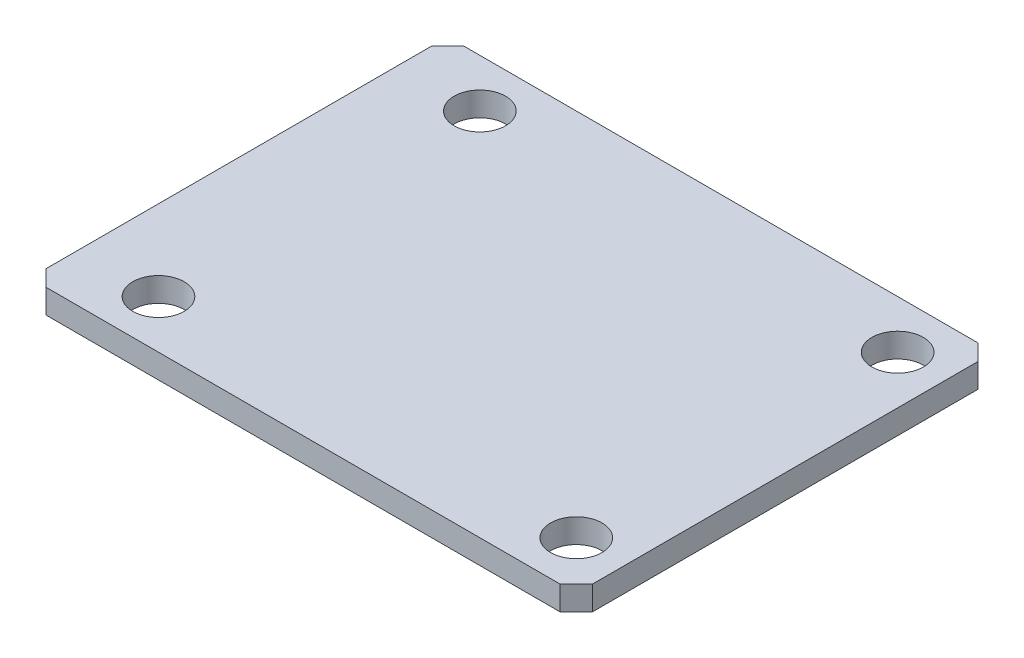
ISO-10303-21;
HEADER;
FILE_DESCRIPTION(('STEP AP214'),'2;1');
FILE_NAME('part.step','',(''),(''),'','','');
FILE_SCHEMA(('AUTOMOTIVE_DESIGN { 1 0 10303 214 1 1 1 1 }'));
ENDSEC;
DATA;
#1=APPLICATION_CONTEXT('core data for automotive mechanical design processes');
#2=APPLICATION_PROTOCOL_DEFINITION('international standard','automotive_design',2000,#1);
#3=PRODUCT_CONTEXT('',#1,'mechanical');
#4=PRODUCT('Part','Part','',(#3));
#5=PRODUCT_RELATED_PRODUCT_CATEGORY('part','',(#4));
#6=PRODUCT_DEFINITION_FORMATION('','',#4);
#7=PRODUCT_DEFINITION_CONTEXT('part definition',#1,'design');
#8=PRODUCT_DEFINITION('design','',#6,#7);
#9=PRODUCT_DEFINITION_SHAPE('','',#8);
#10=(LENGTH_UNIT() NAMED_UNIT(*) SI_UNIT(.MILLI.,.METRE.));
#11=(NAMED_UNIT(*) PLANE_ANGLE_UNIT() SI_UNIT($,.RADIAN.));
#12=(NAMED_UNIT(*) SI_UNIT($,.STERADIAN.) SOLID_ANGLE_UNIT());
#13=UNCERTAINTY_MEASURE_WITH_UNIT(LENGTH_MEASURE(1.E-05),#10,'distance_accuracy_value','');
#14=(GEOMETRIC_REPRESENTATION_CONTEXT(3) GLOBAL_UNCERTAINTY_ASSIGNED_CONTEXT((#13)) GLOBAL_UNIT_ASSIGNED_CONTEXT((#10,
#11,#12)) REPRESENTATION_CONTEXT('',''));
#15=CARTESIAN_POINT('',(0.,0.,0.));
#16=DIRECTION('',(0.,0.,1.));
#17=DIRECTION('',(1.,0.,0.));
#18=AXIS2_PLACEMENT_3D('',#15,#16,#17);
#19=CARTESIAN_POINT('',(-17.,1.5,12.));
#20=DIRECTION('',(1.,0.,0.));
#21=DIRECTION('',(0.,0.,-1.));
#22=AXIS2_PLACEMENT_3D('',#19,#20,#21);
#23=PLANE('',#22);
#24=DIRECTION('',(0.,0.,1.));
#25=VECTOR('',#24,1.);
#26=CARTESIAN_POINT('',(-17.,0.,12.));
#27=LINE('',#26,#25);
#28=CARTESIAN_POINT('',(-17.,0.,-12.));
#29=VERTEX_POINT('',#28);
#30=CARTESIAN_POINT('',(-17.,0.,12.));
#31=VERTEX_POINT('',#30);
#32=EDGE_CURVE('E139',#29,#31,#27,.T.);
#33=ORIENTED_EDGE('',*,*,#32,.T.);
#34=DIRECTION('',(0.,-1.,0.));
#35=VECTOR('',#34,1.);
#36=CARTESIAN_POINT('',(-17.,1.5,12.));
#37=LINE('',#36,#35);
#38=CARTESIAN_POINT('',(-17.,1.5,12.));
#39=VERTEX_POINT('',#38);
#40=EDGE_CURVE('E11',#39,#31,#37,.T.);
#41=ORIENTED_EDGE('',*,*,#40,.F.);
#42=DIRECTION('',(0.,0.,1.));
#43=VECTOR('',#42,1.);
#44=CARTESIAN_POINT('',(-17.,1.5,12.));
#45=LINE('',#44,#43);
#46=CARTESIAN_POINT('',(-17.,1.5,-12.));
#47=VERTEX_POINT('',#46);
#48=EDGE_CURVE('E154',#47,#39,#45,.T.);
#49=ORIENTED_EDGE('',*,*,#48,.F.);
#50=DIRECTION('',(0.,-1.,0.));
#51=VECTOR('',#50,1.);
#52=CARTESIAN_POINT('',(-17.,1.5,-12.));
#53=LINE('',#52,#51);
#54=EDGE_CURVE('E135',#47,#29,#53,.T.);
#55=ORIENTED_EDGE('',*,*,#54,.T.);
#56=EDGE_LOOP('',(#33,#41,#49,#55));
#57=FACE_BOUND('',#56,.T.);
#58=ADVANCED_FACE('F43',(#57),#23,.F.);
#59=CARTESIAN_POINT('',(-17.,1.5,12.));
#60=DIRECTION('',(0.707106781186547,0.,-0.707106781186548));
#61=DIRECTION('',(-0.707106781186548,0.,-0.707106781186547));
#62=AXIS2_PLACEMENT_3D('',#59,#60,#61);
#63=PLANE('',#62);
#64=DIRECTION('',(0.707106781186548,0.,0.707106781186547));
#65=VECTOR('',#64,1.);
#66=CARTESIAN_POINT('',(-17.,0.,12.));
#67=LINE('',#66,#65);
#68=CARTESIAN_POINT('',(-16.,0.,13.));
#69=VERTEX_POINT('',#68);
#70=EDGE_CURVE('E142',#31,#69,#67,.T.);
#71=ORIENTED_EDGE('',*,*,#70,.T.);
#72=DIRECTION('',(0.,-1.,0.));
#73=VECTOR('',#72,1.);
#74=CARTESIAN_POINT('',(-16.,1.5,13.));
#75=LINE('',#74,#73);
#76=CARTESIAN_POINT('',(-16.,1.5,13.));
#77=VERTEX_POINT('',#76);
#78=EDGE_CURVE('E51',#77,#69,#75,.T.);
#79=ORIENTED_EDGE('',*,*,#78,.F.);
#80=DIRECTION('',(0.707106781186548,0.,0.707106781186547));
#81=VECTOR('',#80,1.);
#82=CARTESIAN_POINT('',(-17.,1.5,12.));
#83=LINE('',#82,#81);
#84=EDGE_CURVE('E102',#39,#77,#83,.T.);
#85=ORIENTED_EDGE('',*,*,#84,.F.);
#86=ORIENTED_EDGE('',*,*,#40,.T.);
#87=EDGE_LOOP('',(#71,#79,#85,#86));
#88=FACE_BOUND('',#87,.T.);
#89=ADVANCED_FACE('F236',(#88),#63,.F.);
#90=CARTESIAN_POINT('',(-16.,1.5,13.));
#91=DIRECTION('',(0.,0.,-1.));
#92=DIRECTION('',(-1.,0.,0.));
#93=AXIS2_PLACEMENT_3D('',#90,#91,#92);
#94=PLANE('',#93);
#95=DIRECTION('',(1.,0.,0.));
#96=VECTOR('',#95,1.);
#97=CARTESIAN_POINT('',(-16.,0.,13.));
#98=LINE('',#97,#96);
#99=CARTESIAN_POINT('',(16.,0.,13.));
#100=VERTEX_POINT('',#99);
#101=EDGE_CURVE('E145',#69,#100,#98,.T.);
#102=ORIENTED_EDGE('',*,*,#101,.T.);
#103=DIRECTION('',(0.,-1.,0.));
#104=VECTOR('',#103,1.);
#105=CARTESIAN_POINT('',(16.,1.5,13.));
#106=LINE('',#105,#104);
#107=CARTESIAN_POINT('',(16.,1.5,13.));
#108=VERTEX_POINT('',#107);
#109=EDGE_CURVE('E161',#108,#100,#106,.T.);
#110=ORIENTED_EDGE('',*,*,#109,.F.);
#111=DIRECTION('',(1.,0.,0.));
#112=VECTOR('',#111,1.);
#113=CARTESIAN_POINT('',(-16.,1.5,13.));
#114=LINE('',#113,#112);
#115=EDGE_CURVE('E169',#77,#108,#114,.T.);
#116=ORIENTED_EDGE('',*,*,#115,.F.);
#117=ORIENTED_EDGE('',*,*,#78,.T.);
#118=EDGE_LOOP('',(#102,#110,#116,#117));
#119=FACE_BOUND('',#118,.T.);
#120=ADVANCED_FACE('F167',(#119),#94,.F.);
#121=CARTESIAN_POINT('',(16.,1.5,13.));
#122=DIRECTION('',(-0.707106781186547,0.,-0.707106781186548));
#123=DIRECTION('',(-0.707106781186548,0.,0.707106781186547));
#124=AXIS2_PLACEMENT_3D('',#121,#122,#123);
#125=PLANE('',#124);
#126=DIRECTION('',(0.707106781186548,0.,-0.707106781186547));
#127=VECTOR('',#126,1.);
#128=CARTESIAN_POINT('',(16.,0.,13.));
#129=LINE('',#128,#127);
#130=CARTESIAN_POINT('',(17.,0.,12.));
#131=VERTEX_POINT('',#130);
#132=EDGE_CURVE('E147',#100,#131,#129,.T.);
#133=ORIENTED_EDGE('',*,*,#132,.T.);
#134=DIRECTION('',(0.,-1.,0.));
#135=VECTOR('',#134,1.);
#136=CARTESIAN_POINT('',(17.,1.5,12.));
#137=LINE('',#136,#135);
#138=CARTESIAN_POINT('',(17.,1.5,12.));
#139=VERTEX_POINT('',#138);
#140=EDGE_CURVE('E158',#139,#131,#137,.T.);
#141=ORIENTED_EDGE('',*,*,#140,.F.);
#142=DIRECTION('',(0.707106781186548,0.,-0.707106781186547));
#143=VECTOR('',#142,1.);
#144=CARTESIAN_POINT('',(16.,1.5,13.));
#145=LINE('',#144,#143);
#146=EDGE_CURVE('E181',#108,#139,#145,.T.);
#147=ORIENTED_EDGE('',*,*,#146,.F.);
#148=ORIENTED_EDGE('',*,*,#109,.T.);
#149=EDGE_LOOP('',(#133,#141,#147,#148));
#150=FACE_BOUND('',#149,.T.);
#151=ADVANCED_FACE('F177',(#150),#125,.F.);
#152=CARTESIAN_POINT('',(17.,1.5,12.));
#153=DIRECTION('',(-1.,0.,0.));
#154=DIRECTION('',(0.,0.,1.));
#155=AXIS2_PLACEMENT_3D('',#152,#153,#154);
#156=PLANE('',#155);
#157=DIRECTION('',(0.,0.,-1.));
#158=VECTOR('',#157,1.);
#159=CARTESIAN_POINT('',(17.,0.,12.));
#160=LINE('',#159,#158);
#161=CARTESIAN_POINT('',(17.,0.,-12.));
#162=VERTEX_POINT('',#161);
#163=EDGE_CURVE('E149',#131,#162,#160,.T.);
#164=ORIENTED_EDGE('',*,*,#163,.T.);
#165=DIRECTION('',(0.,-1.,0.));
#166=VECTOR('',#165,1.);
#167=CARTESIAN_POINT('',(17.,1.5,-12.));
#168=LINE('',#167,#166);
#169=CARTESIAN_POINT('',(17.,1.5,-12.));
#170=VERTEX_POINT('',#169);
#171=EDGE_CURVE('E130',#170,#162,#168,.T.);
#172=ORIENTED_EDGE('',*,*,#171,.F.);
#173=DIRECTION('',(0.,0.,-1.));
#174=VECTOR('',#173,1.);
#175=CARTESIAN_POINT('',(17.,1.5,12.));
#176=LINE('',#175,#174);
#177=EDGE_CURVE('E121',#139,#170,#176,.T.);
#178=ORIENTED_EDGE('',*,*,#177,.F.);
#179=ORIENTED_EDGE('',*,*,#140,.T.);
#180=EDGE_LOOP('',(#164,#172,#178,#179));
#181=FACE_BOUND('',#180,.T.);
#182=ADVANCED_FACE('F180',(#181),#156,.F.);
#183=CARTESIAN_POINT('',(16.,1.5,-13.));
#184=DIRECTION('',(-0.707106781186547,0.,0.707106781186548));
#185=DIRECTION('',(0.707106781186548,0.,0.707106781186547));
#186=AXIS2_PLACEMENT_3D('',#183,#184,#185);
#187=PLANE('',#186);
#188=DIRECTION('',(-0.707106781186548,0.,-0.707106781186547));
#189=VECTOR('',#188,1.);
#190=CARTESIAN_POINT('',(16.,0.,-13.));
#191=LINE('',#190,#189);
#192=CARTESIAN_POINT('',(16.,0.,-13.));
#193=VERTEX_POINT('',#192);
#194=EDGE_CURVE('E129',#162,#193,#191,.T.);
#195=ORIENTED_EDGE('',*,*,#194,.T.);
#196=DIRECTION('',(0.,-1.,0.));
#197=VECTOR('',#196,1.);
#198=CARTESIAN_POINT('',(16.,1.5,-13.));
#199=LINE('',#198,#197);
#200=CARTESIAN_POINT('',(16.,1.5,-13.));
#201=VERTEX_POINT('',#200);
#202=EDGE_CURVE('E126',#201,#193,#199,.T.);
#203=ORIENTED_EDGE('',*,*,#202,.F.);
#204=DIRECTION('',(-0.707106781186548,0.,-0.707106781186547));
#205=VECTOR('',#204,1.);
#206=CARTESIAN_POINT('',(16.,1.5,-13.));
#207=LINE('',#206,#205);
#208=EDGE_CURVE('E115',#170,#201,#207,.T.);
#209=ORIENTED_EDGE('',*,*,#208,.F.);
#210=ORIENTED_EDGE('',*,*,#171,.T.);
#211=EDGE_LOOP('',(#195,#203,#209,#210));
#212=FACE_BOUND('',#211,.T.);
#213=ADVANCED_FACE('F127',(#212),#187,.F.);
#214=CARTESIAN_POINT('',(-16.,1.5,-13.));
#215=DIRECTION('',(0.,0.,1.));
#216=DIRECTION('',(1.,0.,0.));
#217=AXIS2_PLACEMENT_3D('',#214,#215,#216);
#218=PLANE('',#217);
#219=DIRECTION('',(-1.,0.,0.));
#220=VECTOR('',#219,1.);
#221=CARTESIAN_POINT('',(-16.,0.,-13.));
#222=LINE('',#221,#220);
#223=CARTESIAN_POINT('',(-16.,0.,-13.));
#224=VERTEX_POINT('',#223);
#225=EDGE_CURVE('E88',#193,#224,#222,.T.);
#226=ORIENTED_EDGE('',*,*,#225,.T.);
#227=DIRECTION('',(0.,-1.,0.));
#228=VECTOR('',#227,1.);
#229=CARTESIAN_POINT('',(-16.,1.5,-13.));
#230=LINE('',#229,#228);
#231=CARTESIAN_POINT('',(-16.,1.5,-13.));
#232=VERTEX_POINT('',#231);
#233=EDGE_CURVE('E131',#232,#224,#230,.T.);
#234=ORIENTED_EDGE('',*,*,#233,.F.);
#235=DIRECTION('',(-1.,0.,0.));
#236=VECTOR('',#235,1.);
#237=CARTESIAN_POINT('',(-16.,1.5,-13.));
#238=LINE('',#237,#236);
#239=EDGE_CURVE('E119',#201,#232,#238,.T.);
#240=ORIENTED_EDGE('',*,*,#239,.F.);
#241=ORIENTED_EDGE('',*,*,#202,.T.);
#242=EDGE_LOOP('',(#226,#234,#240,#241));
#243=FACE_BOUND('',#242,.T.);
#244=ADVANCED_FACE('F133',(#243),#218,.F.);
#245=CARTESIAN_POINT('',(-17.,1.5,-12.));
#246=DIRECTION('',(0.707106781186547,0.,0.707106781186548));
#247=DIRECTION('',(0.707106781186548,0.,-0.707106781186547));
#248=AXIS2_PLACEMENT_3D('',#245,#246,#247);
#249=PLANE('',#248);
#250=DIRECTION('',(-0.707106781186548,0.,0.707106781186547));
#251=VECTOR('',#250,1.);
#252=CARTESIAN_POINT('',(-17.,0.,-12.));
#253=LINE('',#252,#251);
#254=EDGE_CURVE('E94',#224,#29,#253,.T.);
#255=ORIENTED_EDGE('',*,*,#254,.T.);
#256=ORIENTED_EDGE('',*,*,#54,.F.);
#257=DIRECTION('',(-0.707106781186548,0.,0.707106781186547));
#258=VECTOR('',#257,1.);
#259=CARTESIAN_POINT('',(-17.,1.5,-12.));
#260=LINE('',#259,#258);
#261=EDGE_CURVE('E59',#232,#47,#260,.T.);
#262=ORIENTED_EDGE('',*,*,#261,.F.);
#263=ORIENTED_EDGE('',*,*,#233,.T.);
#264=EDGE_LOOP('',(#255,#256,#262,#263));
#265=FACE_BOUND('',#264,.T.);
#266=ADVANCED_FACE('F215',(#265),#249,.F.);
#267=CARTESIAN_POINT('',(0.,1.5,0.));
#268=DIRECTION('',(0.,-1.,0.));
#269=DIRECTION('',(0.,0.,-1.));
#270=AXIS2_PLACEMENT_3D('',#267,#268,#269);
#271=PLANE('',#270);
#272=CARTESIAN_POINT('',(14.,1.5,10.));
#273=DIRECTION('',(0.,1.,0.));
#274=DIRECTION('',(0.,0.,1.));
#275=AXIS2_PLACEMENT_3D('',#272,#273,#274);
#276=CIRCLE('',#275,1.6);
#277=CARTESIAN_POINT('',(14.,1.5,11.6));
#278=VERTEX_POINT('',#277);
#279=EDGE_CURVE('E190',#278,#278,#276,.T.);
#280=ORIENTED_EDGE('',*,*,#279,.F.);
#281=EDGE_LOOP('',(#280));
#282=FACE_BOUND('',#281,.T.);
#283=CARTESIAN_POINT('',(-12.,1.5,-10.));
#284=DIRECTION('',(0.,1.,0.));
#285=DIRECTION('',(0.,0.,1.));
#286=AXIS2_PLACEMENT_3D('',#283,#284,#285);
#287=CIRCLE('',#286,1.6);
#288=CARTESIAN_POINT('',(-12.,1.5,-8.4));
#289=VERTEX_POINT('',#288);
#290=EDGE_CURVE('E196',#289,#289,#287,.T.);
#291=ORIENTED_EDGE('',*,*,#290,.F.);
#292=EDGE_LOOP('',(#291));
#293=FACE_BOUND('',#292,.T.);
#294=CARTESIAN_POINT('',(-12.,1.5,10.));
#295=DIRECTION('',(0.,1.,0.));
#296=DIRECTION('',(0.,0.,1.));
#297=AXIS2_PLACEMENT_3D('',#294,#295,#296);
#298=CIRCLE('',#297,1.6);
#299=CARTESIAN_POINT('',(-12.,1.5,11.6));
#300=VERTEX_POINT('',#299);
#301=EDGE_CURVE('E197',#300,#300,#298,.T.);
#302=ORIENTED_EDGE('',*,*,#301,.F.);
#303=EDGE_LOOP('',(#302));
#304=FACE_BOUND('',#303,.T.);
#305=CARTESIAN_POINT('',(14.,1.5,-10.));
#306=DIRECTION('',(0.,1.,0.));
#307=DIRECTION('',(0.,0.,1.));
#308=AXIS2_PLACEMENT_3D('',#305,#306,#307);
#309=CIRCLE('',#308,1.6);
#310=CARTESIAN_POINT('',(14.,1.5,-8.4));
#311=VERTEX_POINT('',#310);
#312=EDGE_CURVE('E187',#311,#311,#309,.T.);
#313=ORIENTED_EDGE('',*,*,#312,.F.);
#314=EDGE_LOOP('',(#313));
#315=FACE_BOUND('',#314,.T.);
#316=ORIENTED_EDGE('',*,*,#48,.T.);
#317=ORIENTED_EDGE('',*,*,#84,.T.);
#318=ORIENTED_EDGE('',*,*,#115,.T.);
#319=ORIENTED_EDGE('',*,*,#146,.T.);
#320=ORIENTED_EDGE('',*,*,#177,.T.);
#321=ORIENTED_EDGE('',*,*,#208,.T.);
#322=ORIENTED_EDGE('',*,*,#239,.T.);
#323=ORIENTED_EDGE('',*,*,#261,.T.);
#324=EDGE_LOOP('',(#316,#317,#318,#319,#320,#321,#322,#323));
#325=FACE_BOUND('',#324,.T.);
#326=ADVANCED_FACE('F117',(#282,#293,#304,#315,#325),#271,.F.);
#327=CARTESIAN_POINT('',(0.,0.,0.));
#328=DIRECTION('',(0.,-1.,0.));
#329=DIRECTION('',(0.,0.,-1.));
#330=AXIS2_PLACEMENT_3D('',#327,#328,#329);
#331=PLANE('',#330);
#332=CARTESIAN_POINT('',(14.,0.,10.));
#333=DIRECTION('',(0.,1.,0.));
#334=DIRECTION('',(0.,0.,1.));
#335=AXIS2_PLACEMENT_3D('',#332,#333,#334);
#336=CIRCLE('',#335,1.6);
#337=CARTESIAN_POINT('',(14.,0.,11.6));
#338=VERTEX_POINT('',#337);
#339=EDGE_CURVE('E200',#338,#338,#336,.T.);
#340=ORIENTED_EDGE('',*,*,#339,.T.);
#341=EDGE_LOOP('',(#340));
#342=FACE_BOUND('',#341,.T.);
#343=CARTESIAN_POINT('',(-12.,0.,-10.));
#344=DIRECTION('',(0.,1.,0.));
#345=DIRECTION('',(0.,0.,1.));
#346=AXIS2_PLACEMENT_3D('',#343,#344,#345);
#347=CIRCLE('',#346,1.6);
#348=CARTESIAN_POINT('',(-12.,0.,-8.4));
#349=VERTEX_POINT('',#348);
#350=EDGE_CURVE('E193',#349,#349,#347,.T.);
#351=ORIENTED_EDGE('',*,*,#350,.T.);
#352=EDGE_LOOP('',(#351));
#353=FACE_BOUND('',#352,.T.);
#354=CARTESIAN_POINT('',(-12.,0.,10.));
#355=DIRECTION('',(0.,1.,0.));
#356=DIRECTION('',(0.,0.,1.));
#357=AXIS2_PLACEMENT_3D('',#354,#355,#356);
#358=CIRCLE('',#357,1.6);
#359=CARTESIAN_POINT('',(-12.,0.,11.6));
#360=VERTEX_POINT('',#359);
#361=EDGE_CURVE('E205',#360,#360,#358,.T.);
#362=ORIENTED_EDGE('',*,*,#361,.T.);
#363=EDGE_LOOP('',(#362));
#364=FACE_BOUND('',#363,.T.);
#365=CARTESIAN_POINT('',(14.,0.,-10.));
#366=DIRECTION('',(0.,1.,0.));
#367=DIRECTION('',(0.,0.,1.));
#368=AXIS2_PLACEMENT_3D('',#365,#366,#367);
#369=CIRCLE('',#368,1.6);
#370=CARTESIAN_POINT('',(14.,0.,-8.4));
#371=VERTEX_POINT('',#370);
#372=EDGE_CURVE('E143',#371,#371,#369,.T.);
#373=ORIENTED_EDGE('',*,*,#372,.T.);
#374=EDGE_LOOP('',(#373));
#375=FACE_BOUND('',#374,.T.);
#376=ORIENTED_EDGE('',*,*,#32,.F.);
#377=ORIENTED_EDGE('',*,*,#254,.F.);
#378=ORIENTED_EDGE('',*,*,#225,.F.);
#379=ORIENTED_EDGE('',*,*,#194,.F.);
#380=ORIENTED_EDGE('',*,*,#163,.F.);
#381=ORIENTED_EDGE('',*,*,#132,.F.);
#382=ORIENTED_EDGE('',*,*,#101,.F.);
#383=ORIENTED_EDGE('',*,*,#70,.F.);
#384=EDGE_LOOP('',(#376,#377,#378,#379,#380,#381,#382,#383));
#385=FACE_BOUND('',#384,.T.);
#386=ADVANCED_FACE('F173',(#342,#353,#364,#375,#385),#331,.T.);
#387=CARTESIAN_POINT('',(14.,0.,-10.));
#388=DIRECTION('',(0.,1.,0.));
#389=DIRECTION('',(0.,0.,1.));
#390=AXIS2_PLACEMENT_3D('',#387,#388,#389);
#391=CYLINDRICAL_SURFACE('',#390,1.6);
#392=ORIENTED_EDGE('',*,*,#372,.F.);
#393=EDGE_LOOP('',(#392));
#394=FACE_BOUND('',#393,.T.);
#395=ORIENTED_EDGE('',*,*,#312,.T.);
#396=EDGE_LOOP('',(#395));
#397=FACE_BOUND('',#396,.T.);
#398=ADVANCED_FACE('F220',(#394,#397),#391,.F.);
#399=CARTESIAN_POINT('',(-12.,0.,10.));
#400=DIRECTION('',(0.,1.,0.));
#401=DIRECTION('',(0.,0.,1.));
#402=AXIS2_PLACEMENT_3D('',#399,#400,#401);
#403=CYLINDRICAL_SURFACE('',#402,1.6);
#404=ORIENTED_EDGE('',*,*,#361,.F.);
#405=EDGE_LOOP('',(#404));
#406=FACE_BOUND('',#405,.T.);
#407=ORIENTED_EDGE('',*,*,#301,.T.);
#408=EDGE_LOOP('',(#407));
#409=FACE_BOUND('',#408,.T.);
#410=ADVANCED_FACE('F211',(#406,#409),#403,.F.);
#411=CARTESIAN_POINT('',(-12.,0.,-10.));
#412=DIRECTION('',(0.,1.,0.));
#413=DIRECTION('',(0.,0.,1.));
#414=AXIS2_PLACEMENT_3D('',#411,#412,#413);
#415=CYLINDRICAL_SURFACE('',#414,1.6);
#416=ORIENTED_EDGE('',*,*,#350,.F.);
#417=EDGE_LOOP('',(#416));
#418=FACE_BOUND('',#417,.T.);
#419=ORIENTED_EDGE('',*,*,#290,.T.);
#420=EDGE_LOOP('',(#419));
#421=FACE_BOUND('',#420,.T.);
#422=ADVANCED_FACE('F228',(#418,#421),#415,.F.);
#423=CARTESIAN_POINT('',(14.,0.,10.));
#424=DIRECTION('',(0.,1.,0.));
#425=DIRECTION('',(0.,0.,1.));
#426=AXIS2_PLACEMENT_3D('',#423,#424,#425);
#427=CYLINDRICAL_SURFACE('',#426,1.6);
#428=ORIENTED_EDGE('',*,*,#339,.F.);
#429=EDGE_LOOP('',(#428));
#430=FACE_BOUND('',#429,.T.);
#431=ORIENTED_EDGE('',*,*,#279,.T.);
#432=EDGE_LOOP('',(#431));
#433=FACE_BOUND('',#432,.T.);
#434=ADVANCED_FACE('F318',(#430,#433),#427,.F.);
#435=CLOSED_SHELL('',(#58,#89,#120,#151,#182,#213,#244,#266,#326,#386,#398,#410,#422,#434));
#436=MANIFOLD_SOLID_BREP('B2',#435);
#437=ADVANCED_BREP_SHAPE_REPRESENTATION('',(#18,#436),#14);
#438=SHAPE_DEFINITION_REPRESENTATION(#9,#437);
ENDSEC;
END-ISO-10303-21;
